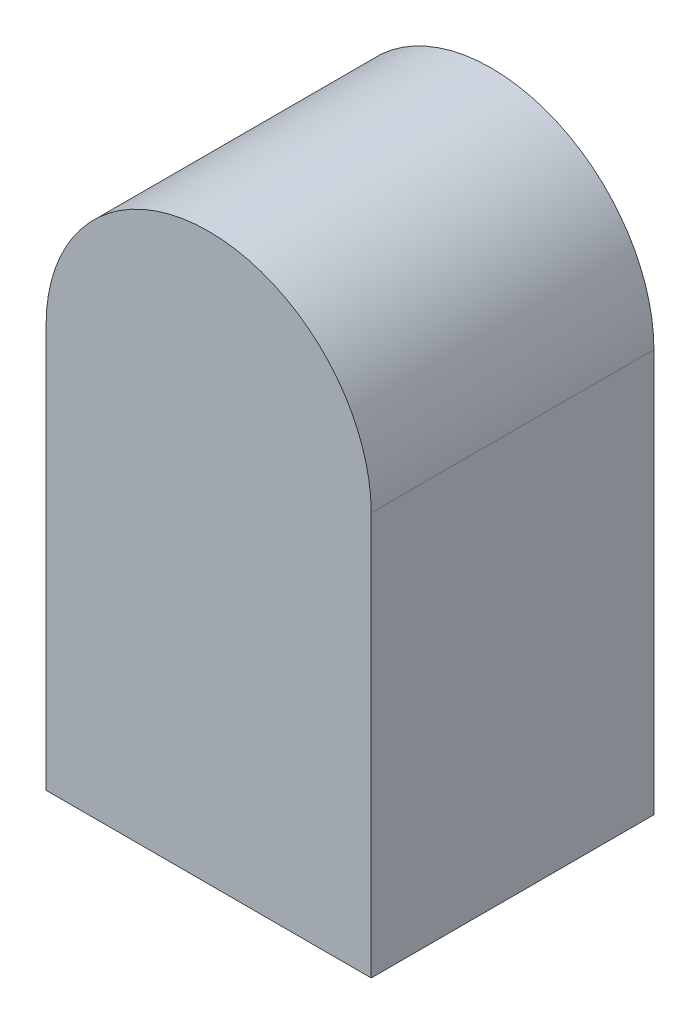
ISO-10303-21;
HEADER;
FILE_DESCRIPTION(('STEP AP214'),'2;1');
FILE_NAME('part.step','',(''),(''),'','','');
FILE_SCHEMA(('AUTOMOTIVE_DESIGN { 1 0 10303 214 1 1 1 1 }'));
ENDSEC;
DATA;
#1=APPLICATION_CONTEXT('core data for automotive mechanical design processes');
#2=APPLICATION_PROTOCOL_DEFINITION('international standard','automotive_design',2000,#1);
#3=PRODUCT_CONTEXT('',#1,'mechanical');
#4=PRODUCT('Part','Part','',(#3));
#5=PRODUCT_RELATED_PRODUCT_CATEGORY('part','',(#4));
#6=PRODUCT_DEFINITION_FORMATION('','',#4);
#7=PRODUCT_DEFINITION_CONTEXT('part definition',#1,'design');
#8=PRODUCT_DEFINITION('design','',#6,#7);
#9=PRODUCT_DEFINITION_SHAPE('','',#8);
#10=(LENGTH_UNIT() NAMED_UNIT(*) SI_UNIT(.MILLI.,.METRE.));
#11=(NAMED_UNIT(*) PLANE_ANGLE_UNIT() SI_UNIT($,.RADIAN.));
#12=(NAMED_UNIT(*) SI_UNIT($,.STERADIAN.) SOLID_ANGLE_UNIT());
#13=UNCERTAINTY_MEASURE_WITH_UNIT(LENGTH_MEASURE(1.E-05),#10,'distance_accuracy_value','');
#14=(GEOMETRIC_REPRESENTATION_CONTEXT(3) GLOBAL_UNCERTAINTY_ASSIGNED_CONTEXT((#13)) GLOBAL_UNIT_ASSIGNED_CONTEXT((#10,
#11,#12)) REPRESENTATION_CONTEXT('',''));
#15=CARTESIAN_POINT('',(0.,0.,0.));
#16=DIRECTION('',(0.,0.,1.));
#17=DIRECTION('',(1.,0.,0.));
#18=AXIS2_PLACEMENT_3D('',#15,#16,#17);
#19=CARTESIAN_POINT('',(-2.25,-2.8335265642716,0.));
#20=DIRECTION('',(0.,0.,1.));
#21=DIRECTION('',(0.,1.,0.));
#22=AXIS2_PLACEMENT_3D('',#19,#20,#21);
#23=PLANE('',#22);
#24=DIRECTION('',(1.,0.,0.));
#25=VECTOR('',#24,1.);
#26=CARTESIAN_POINT('',(-2.365,-3.,0.));
#27=LINE('',#26,#25);
#28=CARTESIAN_POINT('',(-2.365,-3.,0.));
#29=VERTEX_POINT('',#28);
#30=CARTESIAN_POINT('',(-2.135,-3.,0.));
#31=VERTEX_POINT('',#30);
#32=EDGE_CURVE('E11',#29,#31,#27,.T.);
#33=ORIENTED_EDGE('',*,*,#32,.F.);
#34=DIRECTION('',(0.,-1.,0.));
#35=VECTOR('',#34,1.);
#36=CARTESIAN_POINT('',(-2.365,-2.715,0.));
#37=LINE('',#36,#35);
#38=CARTESIAN_POINT('',(-2.365,-2.715,0.));
#39=VERTEX_POINT('',#38);
#40=EDGE_CURVE('E24',#39,#29,#37,.T.);
#41=ORIENTED_EDGE('',*,*,#40,.F.);
#42=CARTESIAN_POINT('',(-2.25,-2.715,0.));
#43=DIRECTION('',(0.,0.,1.));
#44=DIRECTION('',(1.,0.,0.));
#45=AXIS2_PLACEMENT_3D('',#42,#43,#44);
#46=CIRCLE('',#45,0.115);
#47=CARTESIAN_POINT('',(-2.135,-2.715,0.));
#48=VERTEX_POINT('',#47);
#49=EDGE_CURVE('E85',#48,#39,#46,.T.);
#50=ORIENTED_EDGE('',*,*,#49,.F.);
#51=DIRECTION('',(0.,1.,0.));
#52=VECTOR('',#51,1.);
#53=CARTESIAN_POINT('',(-2.135,-3.,0.));
#54=LINE('',#53,#52);
#55=EDGE_CURVE('E82',#31,#48,#54,.T.);
#56=ORIENTED_EDGE('',*,*,#55,.F.);
#57=EDGE_LOOP('',(#33,#41,#50,#56));
#58=FACE_BOUND('',#57,.T.);
#59=ADVANCED_FACE('F17',(#58),#23,.F.);
#60=CARTESIAN_POINT('',(-2.135,-3.,0.));
#61=DIRECTION('',(1.,0.,0.));
#62=DIRECTION('',(0.,1.,0.));
#63=AXIS2_PLACEMENT_3D('',#60,#61,#62);
#64=PLANE('',#63);
#65=ORIENTED_EDGE('',*,*,#55,.T.);
#66=DIRECTION('',(0.,0.,1.));
#67=VECTOR('',#66,1.);
#68=CARTESIAN_POINT('',(-2.135,-2.715,0.));
#69=LINE('',#68,#67);
#70=CARTESIAN_POINT('',(-2.135,-2.715,0.2));
#71=VERTEX_POINT('',#70);
#72=EDGE_CURVE('E80',#48,#71,#69,.T.);
#73=ORIENTED_EDGE('',*,*,#72,.T.);
#74=DIRECTION('',(0.,1.,0.));
#75=VECTOR('',#74,1.);
#76=CARTESIAN_POINT('',(-2.135,-3.,0.2));
#77=LINE('',#76,#75);
#78=CARTESIAN_POINT('',(-2.135,-3.,0.2));
#79=VERTEX_POINT('',#78);
#80=EDGE_CURVE('E78',#79,#71,#77,.T.);
#81=ORIENTED_EDGE('',*,*,#80,.F.);
#82=DIRECTION('',(0.,0.,-1.));
#83=VECTOR('',#82,1.);
#84=CARTESIAN_POINT('',(-2.135,-3.,0.));
#85=LINE('',#84,#83);
#86=EDGE_CURVE('E71',#79,#31,#85,.T.);
#87=ORIENTED_EDGE('',*,*,#86,.T.);
#88=EDGE_LOOP('',(#65,#73,#81,#87));
#89=FACE_BOUND('',#88,.T.);
#90=ADVANCED_FACE('F91',(#89),#64,.T.);
#91=CARTESIAN_POINT('',(-2.25,-2.715,0.));
#92=DIRECTION('',(0.,0.,1.));
#93=DIRECTION('',(1.,0.,0.));
#94=AXIS2_PLACEMENT_3D('',#91,#92,#93);
#95=CYLINDRICAL_SURFACE('',#94,0.115);
#96=ORIENTED_EDGE('',*,*,#49,.T.);
#97=DIRECTION('',(0.,0.,1.));
#98=VECTOR('',#97,1.);
#99=CARTESIAN_POINT('',(-2.365,-2.715,0.));
#100=LINE('',#99,#98);
#101=CARTESIAN_POINT('',(-2.365,-2.715,0.2));
#102=VERTEX_POINT('',#101);
#103=EDGE_CURVE('E75',#39,#102,#100,.T.);
#104=ORIENTED_EDGE('',*,*,#103,.T.);
#105=CARTESIAN_POINT('',(-2.25,-2.715,0.2));
#106=DIRECTION('',(0.,0.,1.));
#107=DIRECTION('',(1.,0.,0.));
#108=AXIS2_PLACEMENT_3D('',#105,#106,#107);
#109=CIRCLE('',#108,0.115);
#110=EDGE_CURVE('E59',#71,#102,#109,.T.);
#111=ORIENTED_EDGE('',*,*,#110,.F.);
#112=ORIENTED_EDGE('',*,*,#72,.F.);
#113=EDGE_LOOP('',(#96,#104,#111,#112));
#114=FACE_BOUND('',#113,.T.);
#115=ADVANCED_FACE('F89',(#114),#95,.T.);
#116=CARTESIAN_POINT('',(-2.365,-2.715,0.));
#117=DIRECTION('',(-1.,0.,0.));
#118=DIRECTION('',(0.,-1.,0.));
#119=AXIS2_PLACEMENT_3D('',#116,#117,#118);
#120=PLANE('',#119);
#121=ORIENTED_EDGE('',*,*,#40,.T.);
#122=DIRECTION('',(0.,0.,1.));
#123=VECTOR('',#122,1.);
#124=CARTESIAN_POINT('',(-2.365,-3.,0.));
#125=LINE('',#124,#123);
#126=CARTESIAN_POINT('',(-2.365,-3.,0.2));
#127=VERTEX_POINT('',#126);
#128=EDGE_CURVE('E53',#29,#127,#125,.T.);
#129=ORIENTED_EDGE('',*,*,#128,.T.);
#130=DIRECTION('',(0.,-1.,0.));
#131=VECTOR('',#130,1.);
#132=CARTESIAN_POINT('',(-2.365,-2.715,0.2));
#133=LINE('',#132,#131);
#134=EDGE_CURVE('E57',#102,#127,#133,.T.);
#135=ORIENTED_EDGE('',*,*,#134,.F.);
#136=ORIENTED_EDGE('',*,*,#103,.F.);
#137=EDGE_LOOP('',(#121,#129,#135,#136));
#138=FACE_BOUND('',#137,.T.);
#139=ADVANCED_FACE('F55',(#138),#120,.T.);
#140=CARTESIAN_POINT('',(-3.,-3.,0.));
#141=DIRECTION('',(0.,-1.,0.));
#142=DIRECTION('',(1.,0.,0.));
#143=AXIS2_PLACEMENT_3D('',#140,#141,#142);
#144=PLANE('',#143);
#145=ORIENTED_EDGE('',*,*,#86,.F.);
#146=DIRECTION('',(1.,0.,0.));
#147=VECTOR('',#146,1.);
#148=CARTESIAN_POINT('',(-2.625,-3.,0.2));
#149=LINE('',#148,#147);
#150=EDGE_CURVE('E66',#127,#79,#149,.T.);
#151=ORIENTED_EDGE('',*,*,#150,.F.);
#152=ORIENTED_EDGE('',*,*,#128,.F.);
#153=ORIENTED_EDGE('',*,*,#32,.T.);
#154=EDGE_LOOP('',(#145,#151,#152,#153));
#155=FACE_BOUND('',#154,.T.);
#156=ADVANCED_FACE('F69',(#155),#144,.T.);
#157=CARTESIAN_POINT('',(-2.25,-2.8335240809167,0.2));
#158=DIRECTION('',(0.,0.,1.));
#159=DIRECTION('',(1.,0.,0.));
#160=AXIS2_PLACEMENT_3D('',#157,#158,#159);
#161=PLANE('',#160);
#162=ORIENTED_EDGE('',*,*,#134,.T.);
#163=ORIENTED_EDGE('',*,*,#150,.T.);
#164=ORIENTED_EDGE('',*,*,#80,.T.);
#165=ORIENTED_EDGE('',*,*,#110,.T.);
#166=EDGE_LOOP('',(#162,#163,#164,#165));
#167=FACE_BOUND('',#166,.T.);
#168=ADVANCED_FACE('F64',(#167),#161,.T.);
#169=CLOSED_SHELL('',(#59,#90,#115,#139,#156,#168));
#170=MANIFOLD_SOLID_BREP('B1',#169);
#171=ADVANCED_BREP_SHAPE_REPRESENTATION('',(#18,#170),#14);
#172=SHAPE_DEFINITION_REPRESENTATION(#9,#171);
ENDSEC;
END-ISO-10303-21;
